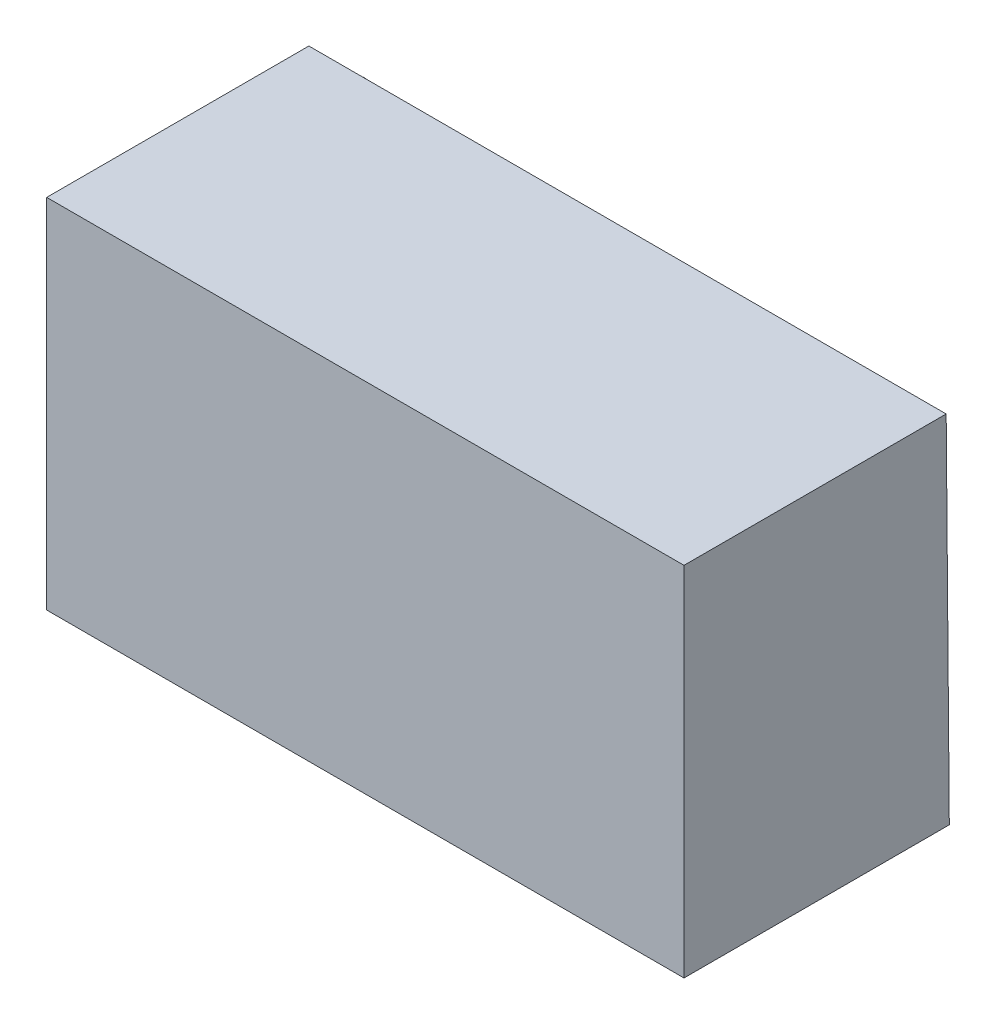
ISO-10303-21;
HEADER;
FILE_DESCRIPTION(('STEP AP214'),'2;1');
FILE_NAME('part.step','',(''),(''),'','','');
FILE_SCHEMA(('AUTOMOTIVE_DESIGN { 1 0 10303 214 1 1 1 1 }'));
ENDSEC;
DATA;
#1=APPLICATION_CONTEXT('core data for automotive mechanical design processes');
#2=APPLICATION_PROTOCOL_DEFINITION('international standard','automotive_design',2000,#1);
#3=PRODUCT_CONTEXT('',#1,'mechanical');
#4=PRODUCT('Part','Part','',(#3));
#5=PRODUCT_RELATED_PRODUCT_CATEGORY('part','',(#4));
#6=PRODUCT_DEFINITION_FORMATION('','',#4);
#7=PRODUCT_DEFINITION_CONTEXT('part definition',#1,'design');
#8=PRODUCT_DEFINITION('design','',#6,#7);
#9=PRODUCT_DEFINITION_SHAPE('','',#8);
#10=(LENGTH_UNIT() NAMED_UNIT(*) SI_UNIT(.MILLI.,.METRE.));
#11=(NAMED_UNIT(*) PLANE_ANGLE_UNIT() SI_UNIT($,.RADIAN.));
#12=(NAMED_UNIT(*) SI_UNIT($,.STERADIAN.) SOLID_ANGLE_UNIT());
#13=UNCERTAINTY_MEASURE_WITH_UNIT(LENGTH_MEASURE(1.E-05),#10,'distance_accuracy_value','');
#14=(GEOMETRIC_REPRESENTATION_CONTEXT(3) GLOBAL_UNCERTAINTY_ASSIGNED_CONTEXT((#13)) GLOBAL_UNIT_ASSIGNED_CONTEXT((#10,
#11,#12)) REPRESENTATION_CONTEXT('',''));
#15=CARTESIAN_POINT('',(0.,0.,0.));
#16=DIRECTION('',(0.,0.,1.));
#17=DIRECTION('',(1.,0.,0.));
#18=AXIS2_PLACEMENT_3D('',#15,#16,#17);
#19=CARTESIAN_POINT('',(-4.00000000000008,22.9122396448505,110.199952086171));
#20=DIRECTION('',(0.,-1.,0.));
#21=DIRECTION('',(1.,0.,0.));
#22=AXIS2_PLACEMENT_3D('',#19,#20,#21);
#23=PLANE('',#22);
#24=DIRECTION('',(1.,0.,0.));
#25=VECTOR('',#24,1.);
#26=CARTESIAN_POINT('',(190.,22.9122396448505,160.));
#27=LINE('',#26,#25);
#28=CARTESIAN_POINT('',(-123.631953553335,22.9122396448505,160.));
#29=VERTEX_POINT('',#28);
#30=CARTESIAN_POINT('',(-4.00000000000009,22.9122396448505,160.));
#31=VERTEX_POINT('',#30);
#32=EDGE_CURVE('E171',#29,#31,#27,.T.);
#33=ORIENTED_EDGE('',*,*,#32,.F.);
#34=DIRECTION('',(0.,0.,1.));
#35=VECTOR('',#34,1.);
#36=CARTESIAN_POINT('',(-123.631953553335,22.9122396448505,110.199952086171));
#37=LINE('',#36,#35);
#38=CARTESIAN_POINT('',(-123.631953553335,22.9122396448505,110.199952086171));
#39=VERTEX_POINT('',#38);
#40=EDGE_CURVE('E11',#39,#29,#37,.T.);
#41=ORIENTED_EDGE('',*,*,#40,.F.);
#42=DIRECTION('',(1.,0.,0.));
#43=VECTOR('',#42,1.);
#44=CARTESIAN_POINT('',(-135.,22.9122396448505,110.199952086171));
#45=LINE('',#44,#43);
#46=CARTESIAN_POINT('',(-4.00000000000009,22.9122396448505,110.199952086171));
#47=VERTEX_POINT('',#46);
#48=EDGE_CURVE('E183',#47,#39,#45,.F.);
#49=ORIENTED_EDGE('',*,*,#48,.F.);
#50=DIRECTION('',(0.,0.,1.));
#51=VECTOR('',#50,1.);
#52=CARTESIAN_POINT('',(-4.00000000000008,22.9122396448505,110.199952086171));
#53=LINE('',#52,#51);
#54=EDGE_CURVE('E49',#47,#31,#53,.T.);
#55=ORIENTED_EDGE('',*,*,#54,.T.);
#56=EDGE_LOOP('',(#33,#41,#49,#55));
#57=FACE_BOUND('',#56,.T.);
#58=ADVANCED_FACE('F39',(#57),#23,.T.);
#59=CARTESIAN_POINT('',(-123.631953553335,22.9122396448505,110.199952086171));
#60=DIRECTION('',(-1.,0.,0.));
#61=DIRECTION('',(0.,0.,1.));
#62=AXIS2_PLACEMENT_3D('',#59,#60,#61);
#63=PLANE('',#62);
#64=DIRECTION('',(0.,-1.,0.));
#65=VECTOR('',#64,1.);
#66=CARTESIAN_POINT('',(-123.631953553335,125.,160.));
#67=LINE('',#66,#65);
#68=CARTESIAN_POINT('',(-123.631953553335,90.0001903846792,160.));
#69=VERTEX_POINT('',#68);
#70=EDGE_CURVE('E174',#69,#29,#67,.T.);
#71=ORIENTED_EDGE('',*,*,#70,.F.);
#72=DIRECTION('',(0.,0.,1.));
#73=VECTOR('',#72,1.);
#74=CARTESIAN_POINT('',(-123.631953553335,90.0001903846792,110.78541976263));
#75=LINE('',#74,#73);
#76=CARTESIAN_POINT('',(-123.631953553335,90.0001903846792,110.78541976263));
#77=VERTEX_POINT('',#76);
#78=EDGE_CURVE('E164',#77,#69,#75,.T.);
#79=ORIENTED_EDGE('',*,*,#78,.F.);
#80=DIRECTION('',(0.,-0.999961923064171,-0.00872653549837395));
#81=VECTOR('',#80,1.);
#82=CARTESIAN_POINT('',(-123.631953553335,0.,110.));
#83=LINE('',#82,#81);
#84=EDGE_CURVE('E186',#39,#77,#83,.F.);
#85=ORIENTED_EDGE('',*,*,#84,.F.);
#86=ORIENTED_EDGE('',*,*,#40,.T.);
#87=EDGE_LOOP('',(#71,#79,#85,#86));
#88=FACE_BOUND('',#87,.T.);
#89=ADVANCED_FACE('F405',(#88),#63,.T.);
#90=CARTESIAN_POINT('',(-4.00000000000008,22.9122396448505,110.199952086171));
#91=DIRECTION('',(1.,0.,0.));
#92=DIRECTION('',(0.,0.,-1.));
#93=AXIS2_PLACEMENT_3D('',#90,#91,#92);
#94=PLANE('',#93);
#95=DIRECTION('',(0.,1.,0.));
#96=VECTOR('',#95,1.);
#97=CARTESIAN_POINT('',(-4.00000000000009,125.,160.));
#98=LINE('',#97,#96);
#99=CARTESIAN_POINT('',(-4.00000000000009,90.0001903846792,160.));
#100=VERTEX_POINT('',#99);
#101=EDGE_CURVE('E180',#31,#100,#98,.T.);
#102=ORIENTED_EDGE('',*,*,#101,.F.);
#103=ORIENTED_EDGE('',*,*,#54,.F.);
#104=DIRECTION('',(0.,0.999961923064171,0.00872653549837395));
#105=VECTOR('',#104,1.);
#106=CARTESIAN_POINT('',(-4.00000000000009,0.,110.));
#107=LINE('',#106,#105);
#108=CARTESIAN_POINT('',(-4.00000000000009,90.0001903846792,110.78541976263));
#109=VERTEX_POINT('',#108);
#110=EDGE_CURVE('E43',#109,#47,#107,.F.);
#111=ORIENTED_EDGE('',*,*,#110,.F.);
#112=DIRECTION('',(0.,0.,1.));
#113=VECTOR('',#112,1.);
#114=CARTESIAN_POINT('',(-4.00000000000008,90.0001903846792,110.78541976263));
#115=LINE('',#114,#113);
#116=EDGE_CURVE('E167',#109,#100,#115,.T.);
#117=ORIENTED_EDGE('',*,*,#116,.T.);
#118=EDGE_LOOP('',(#102,#103,#111,#117));
#119=FACE_BOUND('',#118,.T.);
#120=ADVANCED_FACE('F204',(#119),#94,.T.);
#121=CARTESIAN_POINT('',(-4.00000000000008,90.0001903846792,110.78541976263));
#122=DIRECTION('',(0.,1.,0.));
#123=DIRECTION('',(-1.,0.,0.));
#124=AXIS2_PLACEMENT_3D('',#121,#122,#123);
#125=PLANE('',#124);
#126=DIRECTION('',(-1.,0.,0.));
#127=VECTOR('',#126,1.);
#128=CARTESIAN_POINT('',(190.,90.0001903846792,160.));
#129=LINE('',#128,#127);
#130=EDGE_CURVE('E177',#100,#69,#129,.T.);
#131=ORIENTED_EDGE('',*,*,#130,.F.);
#132=ORIENTED_EDGE('',*,*,#116,.F.);
#133=DIRECTION('',(-1.,0.,0.));
#134=VECTOR('',#133,1.);
#135=CARTESIAN_POINT('',(-135.,90.0001903846792,110.78541976263));
#136=LINE('',#135,#134);
#137=EDGE_CURVE('E188',#77,#109,#136,.F.);
#138=ORIENTED_EDGE('',*,*,#137,.F.);
#139=ORIENTED_EDGE('',*,*,#78,.T.);
#140=EDGE_LOOP('',(#131,#132,#138,#139));
#141=FACE_BOUND('',#140,.T.);
#142=ADVANCED_FACE('F396',(#141),#125,.T.);
#143=CARTESIAN_POINT('',(190.,125.,160.));
#144=DIRECTION('',(0.,0.,1.));
#145=DIRECTION('',(1.,0.,0.));
#146=AXIS2_PLACEMENT_3D('',#143,#144,#145);
#147=PLANE('',#146);
#148=ORIENTED_EDGE('',*,*,#32,.T.);
#149=ORIENTED_EDGE('',*,*,#101,.T.);
#150=ORIENTED_EDGE('',*,*,#130,.T.);
#151=ORIENTED_EDGE('',*,*,#70,.T.);
#152=EDGE_LOOP('',(#148,#149,#150,#151));
#153=FACE_BOUND('',#152,.T.);
#154=ADVANCED_FACE('F394',(#153),#147,.T.);
#155=CARTESIAN_POINT('',(-135.,0.,110.));
#156=DIRECTION('',(0.,-0.00872653549837395,0.999961923064171));
#157=DIRECTION('',(0.,-0.999961923064171,-0.00872653549837395));
#158=AXIS2_PLACEMENT_3D('',#155,#156,#157);
#159=PLANE('',#158);
#160=CARTESIAN_POINT('',(-115.741787099636,85.0003807693583,110.741787085138));
#161=DIRECTION('',(0.,-0.00872653549837395,0.999961923064171));
#162=DIRECTION('',(0.,-0.999961923064171,-0.00872653549837395));
#163=AXIS2_PLACEMENT_3D('',#160,#161,#162);
#164=CIRCLE('',#163,2.5);
#165=CARTESIAN_POINT('',(-115.741787099636,82.5004759616979,110.719970746392));
#166=VERTEX_POINT('',#165);
#167=EDGE_CURVE('E262',#166,#166,#164,.T.);
#168=ORIENTED_EDGE('',*,*,#167,.T.);
#169=EDGE_LOOP('',(#168));
#170=FACE_BOUND('',#169,.T.);
#171=DIRECTION('',(1.,0.,0.));
#172=VECTOR('',#171,1.);
#173=CARTESIAN_POINT('',(-39.0000000000001,32.9118588754922,110.287217441155));
#174=LINE('',#173,#172);
#175=CARTESIAN_POINT('',(-39.0000000000001,32.9118588754922,110.287217441155));
#176=VERTEX_POINT('',#175);
#177=CARTESIAN_POINT('',(-19.0000000000001,32.9118588754922,110.287217441155));
#178=VERTEX_POINT('',#177);
#179=EDGE_CURVE('E244',#176,#178,#174,.T.);
#180=ORIENTED_EDGE('',*,*,#179,.T.);
#181=DIRECTION('',(0.,0.999961923064171,0.00872653549837399));
#182=VECTOR('',#181,1.);
#183=CARTESIAN_POINT('',(-19.0000000000001,47.9112877214548,110.41811547363));
#184=LINE('',#183,#182);
#185=CARTESIAN_POINT('',(-19.0000000000001,47.9112877214548,110.41811547363));
#186=VERTEX_POINT('',#185);
#187=EDGE_CURVE('E256',#178,#186,#184,.T.);
#188=ORIENTED_EDGE('',*,*,#187,.T.);
#189=DIRECTION('',(-1.,0.,0.));
#190=VECTOR('',#189,1.);
#191=CARTESIAN_POINT('',(-39.0000000000001,47.9112877214548,110.41811547363));
#192=LINE('',#191,#190);
#193=CARTESIAN_POINT('',(-39.0000000000001,47.9112877214548,110.41811547363));
#194=VERTEX_POINT('',#193);
#195=EDGE_CURVE('E58',#186,#194,#192,.T.);
#196=ORIENTED_EDGE('',*,*,#195,.T.);
#197=DIRECTION('',(0.,-0.999961923064171,-0.008726535498374));
#198=VECTOR('',#197,1.);
#199=CARTESIAN_POINT('',(-39.0000000000001,47.9112877214548,110.41811547363));
#200=LINE('',#199,#198);
#201=EDGE_CURVE('E258',#194,#176,#200,.T.);
#202=ORIENTED_EDGE('',*,*,#201,.T.);
#203=EDGE_LOOP('',(#180,#188,#196,#202));
#204=FACE_BOUND('',#203,.T.);
#205=CARTESIAN_POINT('',(-31.0000000000001,66.910564259674,110.583919648099));
#206=DIRECTION('',(0.,-0.00872653549837395,0.999961923064171));
#207=DIRECTION('',(0.,-0.999961923064171,-0.00872653549837395));
#208=AXIS2_PLACEMENT_3D('',#205,#206,#207);
#209=CIRCLE('',#208,8.00000000000003);
#210=CARTESIAN_POINT('',(-31.0000000000001,58.9108688751606,110.514107364112));
#211=VERTEX_POINT('',#210);
#212=EDGE_CURVE('E255',#211,#211,#209,.T.);
#213=ORIENTED_EDGE('',*,*,#212,.T.);
#214=EDGE_LOOP('',(#213));
#215=FACE_BOUND('',#214,.T.);
#216=DIRECTION('',(1.,0.,0.));
#217=VECTOR('',#216,1.);
#218=CARTESIAN_POINT('',(-90.0000000000001,32.9118588754922,110.287217441155));
#219=LINE('',#218,#217);
#220=CARTESIAN_POINT('',(-90.0000000000001,32.9118588754922,110.287217441155));
#221=VERTEX_POINT('',#220);
#222=CARTESIAN_POINT('',(-59.0000000000001,32.9118588754922,110.287217441155));
#223=VERTEX_POINT('',#222);
#224=EDGE_CURVE('E336',#221,#223,#219,.T.);
#225=ORIENTED_EDGE('',*,*,#224,.T.);
#226=DIRECTION('',(0.,0.999961923064171,0.008726535498374));
#227=VECTOR('',#226,1.);
#228=CARTESIAN_POINT('',(-59.0000000000001,47.9112877214548,110.41811547363));
#229=LINE('',#228,#227);
#230=CARTESIAN_POINT('',(-59.0000000000001,47.9112877214548,110.41811547363));
#231=VERTEX_POINT('',#230);
#232=EDGE_CURVE('E302',#223,#231,#229,.T.);
#233=ORIENTED_EDGE('',*,*,#232,.T.);
#234=DIRECTION('',(-1.,0.,0.));
#235=VECTOR('',#234,1.);
#236=CARTESIAN_POINT('',(-90.0000000000001,47.9112877214548,110.41811547363));
#237=LINE('',#236,#235);
#238=CARTESIAN_POINT('',(-90.0000000000001,47.9112877214548,110.41811547363));
#239=VERTEX_POINT('',#238);
#240=EDGE_CURVE('E320',#231,#239,#237,.T.);
#241=ORIENTED_EDGE('',*,*,#240,.T.);
#242=DIRECTION('',(0.,-0.999961923064171,-0.008726535498374));
#243=VECTOR('',#242,1.);
#244=CARTESIAN_POINT('',(-90.0000000000001,47.9112877214548,110.41811547363));
#245=LINE('',#244,#243);
#246=EDGE_CURVE('E295',#239,#221,#245,.T.);
#247=ORIENTED_EDGE('',*,*,#246,.T.);
#248=EDGE_LOOP('',(#225,#233,#241,#247));
#249=FACE_BOUND('',#248,.T.);
#250=DIRECTION('',(1.,0.,0.));
#251=VECTOR('',#250,1.);
#252=CARTESIAN_POINT('',(-90.0000000000001,59.9108307982248,110.522833899611));
#253=LINE('',#252,#251);
#254=CARTESIAN_POINT('',(-90.0000000000001,59.9108307982248,110.522833899611));
#255=VERTEX_POINT('',#254);
#256=CARTESIAN_POINT('',(-59.0000000000001,59.9108307982248,110.522833899611));
#257=VERTEX_POINT('',#256);
#258=EDGE_CURVE('E123',#255,#257,#253,.T.);
#259=ORIENTED_EDGE('',*,*,#258,.T.);
#260=DIRECTION('',(0.,0.999961923064171,0.00872653549837399));
#261=VECTOR('',#260,1.);
#262=CARTESIAN_POINT('',(-59.,74.9102596441874,110.653731932086));
#263=LINE('',#262,#261);
#264=CARTESIAN_POINT('',(-59.,74.9102596441874,110.653731932086));
#265=VERTEX_POINT('',#264);
#266=EDGE_CURVE('E160',#257,#265,#263,.T.);
#267=ORIENTED_EDGE('',*,*,#266,.T.);
#268=DIRECTION('',(-1.,0.,0.));
#269=VECTOR('',#268,1.);
#270=CARTESIAN_POINT('',(-90.0000000000001,74.9102596441874,110.653731932086));
#271=LINE('',#270,#269);
#272=CARTESIAN_POINT('',(-90.0000000000001,74.9102596441874,110.653731932086));
#273=VERTEX_POINT('',#272);
#274=EDGE_CURVE('E144',#265,#273,#271,.T.);
#275=ORIENTED_EDGE('',*,*,#274,.T.);
#276=DIRECTION('',(0.,-0.999961923064171,-0.00872653549837399));
#277=VECTOR('',#276,1.);
#278=CARTESIAN_POINT('',(-90.0000000000001,74.9102596441874,110.653731932086));
#279=LINE('',#278,#277);
#280=EDGE_CURVE('E159',#273,#255,#279,.T.);
#281=ORIENTED_EDGE('',*,*,#280,.T.);
#282=EDGE_LOOP('',(#259,#267,#275,#281));
#283=FACE_BOUND('',#282,.T.);
#284=ORIENTED_EDGE('',*,*,#137,.T.);
#285=ORIENTED_EDGE('',*,*,#110,.T.);
#286=ORIENTED_EDGE('',*,*,#48,.T.);
#287=ORIENTED_EDGE('',*,*,#84,.T.);
#288=EDGE_LOOP('',(#284,#285,#286,#287));
#289=FACE_BOUND('',#288,.T.);
#290=ADVANCED_FACE('F41',(#170,#204,#215,#249,#283,#289),#159,.F.);
#291=CARTESIAN_POINT('',(0.,-0.938066015055126,107.491718426144));
#292=DIRECTION('',(0.,0.0087265354960363,-0.999961923064192));
#293=DIRECTION('',(0.,0.999961923064192,0.0087265354960363));
#294=AXIS2_PLACEMENT_3D('',#291,#292,#293);
#295=PLANE('',#294);
#296=CARTESIAN_POINT('',(-115.741787099636,85.0221971081043,108.241882277478));
#297=DIRECTION('',(0.,-0.00872653549837395,0.999961923064171));
#298=DIRECTION('',(0.,-0.999961923064171,-0.00872653549837395));
#299=AXIS2_PLACEMENT_3D('',#296,#297,#298);
#300=CIRCLE('',#299,2.5);
#301=CARTESIAN_POINT('',(-115.741787099636,82.5222923004438,108.220065938732));
#302=VERTEX_POINT('',#301);
#303=EDGE_CURVE('E156',#302,#302,#300,.F.);
#304=ORIENTED_EDGE('',*,*,#303,.T.);
#305=EDGE_LOOP('',(#304));
#306=FACE_BOUND('',#305,.T.);
#307=ADVANCED_FACE('F402',(#306),#295,.T.);
#308=CARTESIAN_POINT('',(2.92580071804906E-13,-0.938066015304696,107.491718425941));
#309=DIRECTION('',(0.,0.00872653549837427,-0.999961923064171));
#310=DIRECTION('',(0.,0.999961923064171,0.00872653549837427));
#311=AXIS2_PLACEMENT_3D('',#308,#309,#310);
#312=PLANE('',#311);
#313=DIRECTION('',(1.,0.,0.));
#314=VECTOR('',#313,1.);
#315=CARTESIAN_POINT('',(-135.,32.9336752142381,107.787312633494));
#316=LINE('',#315,#314);
#317=CARTESIAN_POINT('',(-19.0000000000001,32.9336752142381,107.787312633494));
#318=VERTEX_POINT('',#317);
#319=CARTESIAN_POINT('',(-39.0000000000001,32.9336752142381,107.787312633494));
#320=VERTEX_POINT('',#319);
#321=EDGE_CURVE('E284',#318,#320,#316,.F.);
#322=ORIENTED_EDGE('',*,*,#321,.T.);
#323=DIRECTION('',(0.,-0.999961923064171,-0.00872653549837395));
#324=VECTOR('',#323,1.);
#325=CARTESIAN_POINT('',(-39.0000000000001,0.0218163387459793,107.50009519234));
#326=LINE('',#325,#324);
#327=CARTESIAN_POINT('',(-39.0000000000001,47.9331040602007,107.91821066597));
#328=VERTEX_POINT('',#327);
#329=EDGE_CURVE('E265',#320,#328,#326,.F.);
#330=ORIENTED_EDGE('',*,*,#329,.T.);
#331=DIRECTION('',(-1.,0.,0.));
#332=VECTOR('',#331,1.);
#333=CARTESIAN_POINT('',(-135.,47.9331040602006,107.91821066597));
#334=LINE('',#333,#332);
#335=CARTESIAN_POINT('',(-19.0000000000001,47.9331040602007,107.91821066597));
#336=VERTEX_POINT('',#335);
#337=EDGE_CURVE('E464',#328,#336,#334,.F.);
#338=ORIENTED_EDGE('',*,*,#337,.T.);
#339=DIRECTION('',(0.,0.999961923064171,0.00872653549837395));
#340=VECTOR('',#339,1.);
#341=CARTESIAN_POINT('',(-19.0000000000001,0.0218163387459349,107.50009519234));
#342=LINE('',#341,#340);
#343=EDGE_CURVE('E291',#336,#318,#342,.F.);
#344=ORIENTED_EDGE('',*,*,#343,.T.);
#345=EDGE_LOOP('',(#322,#330,#338,#344));
#346=FACE_BOUND('',#345,.T.);
#347=ADVANCED_FACE('F391',(#346),#312,.T.);
#348=CARTESIAN_POINT('',(0.,-0.938066015304708,107.491718425941));
#349=DIRECTION('',(0.,0.0087265354983744,-0.999961923064171));
#350=DIRECTION('',(0.,0.999961923064171,0.0087265354983744));
#351=AXIS2_PLACEMENT_3D('',#348,#349,#350);
#352=PLANE('',#351);
#353=CARTESIAN_POINT('',(-31.0000000000001,66.93238059842,108.084014840439));
#354=DIRECTION('',(0.,-0.00872653549837395,0.999961923064171));
#355=DIRECTION('',(0.,-0.999961923064171,-0.00872653549837395));
#356=AXIS2_PLACEMENT_3D('',#353,#354,#355);
#357=CIRCLE('',#356,8.00000000000003);
#358=CARTESIAN_POINT('',(-31.0000000000001,58.9326852139066,108.014202556452));
#359=VERTEX_POINT('',#358);
#360=EDGE_CURVE('E287',#359,#359,#357,.F.);
#361=ORIENTED_EDGE('',*,*,#360,.T.);
#362=EDGE_LOOP('',(#361));
#363=FACE_BOUND('',#362,.T.);
#364=ADVANCED_FACE('F383',(#363),#352,.T.);
#365=CARTESIAN_POINT('',(0.,-0.938066015304607,107.491718425941));
#366=DIRECTION('',(0.,0.00872653549837343,-0.999961923064171));
#367=DIRECTION('',(0.,0.999961923064171,0.00872653549837343));
#368=AXIS2_PLACEMENT_3D('',#365,#366,#367);
#369=PLANE('',#368);
#370=DIRECTION('',(1.,0.,0.));
#371=VECTOR('',#370,1.);
#372=CARTESIAN_POINT('',(-135.,32.9336752142381,107.787312633494));
#373=LINE('',#372,#371);
#374=CARTESIAN_POINT('',(-59.0000000000001,32.9336752142381,107.787312633494));
#375=VERTEX_POINT('',#374);
#376=CARTESIAN_POINT('',(-90.,32.9336752142381,107.787312633494));
#377=VERTEX_POINT('',#376);
#378=EDGE_CURVE('E292',#375,#377,#373,.F.);
#379=ORIENTED_EDGE('',*,*,#378,.T.);
#380=DIRECTION('',(0.,-0.999961923064171,-0.00872653549837395));
#381=VECTOR('',#380,1.);
#382=CARTESIAN_POINT('',(-90.0000000000001,0.0218163387459349,107.50009519234));
#383=LINE('',#382,#381);
#384=CARTESIAN_POINT('',(-90.,47.9331040602007,107.91821066597));
#385=VERTEX_POINT('',#384);
#386=EDGE_CURVE('E317',#377,#385,#383,.F.);
#387=ORIENTED_EDGE('',*,*,#386,.T.);
#388=DIRECTION('',(-1.,0.,0.));
#389=VECTOR('',#388,1.);
#390=CARTESIAN_POINT('',(-135.,47.9331040602007,107.91821066597));
#391=LINE('',#390,#389);
#392=CARTESIAN_POINT('',(-59.0000000000001,47.9331040602007,107.91821066597));
#393=VERTEX_POINT('',#392);
#394=EDGE_CURVE('E298',#385,#393,#391,.F.);
#395=ORIENTED_EDGE('',*,*,#394,.T.);
#396=DIRECTION('',(0.,0.999961923064171,0.00872653549837395));
#397=VECTOR('',#396,1.);
#398=CARTESIAN_POINT('',(-59.,0.0218163387460052,107.50009519234));
#399=LINE('',#398,#397);
#400=EDGE_CURVE('E115',#393,#375,#399,.F.);
#401=ORIENTED_EDGE('',*,*,#400,.T.);
#402=EDGE_LOOP('',(#379,#387,#395,#401));
#403=FACE_BOUND('',#402,.T.);
#404=ADVANCED_FACE('F381',(#403),#369,.T.);
#405=CARTESIAN_POINT('',(0.,-0.938066015304107,107.491718425942));
#406=DIRECTION('',(0.,0.00872653549836875,-0.999961923064171));
#407=DIRECTION('',(0.,0.999961923064171,0.00872653549836875));
#408=AXIS2_PLACEMENT_3D('',#405,#406,#407);
#409=PLANE('',#408);
#410=DIRECTION('',(1.,0.,0.));
#411=VECTOR('',#410,1.);
#412=CARTESIAN_POINT('',(-135.,59.9326471369708,108.02292909195));
#413=LINE('',#412,#411);
#414=CARTESIAN_POINT('',(-59.0000000000001,59.9326471369708,108.02292909195));
#415=VERTEX_POINT('',#414);
#416=CARTESIAN_POINT('',(-90.0000000000001,59.9326471369708,108.02292909195));
#417=VERTEX_POINT('',#416);
#418=EDGE_CURVE('E103',#415,#417,#413,.F.);
#419=ORIENTED_EDGE('',*,*,#418,.T.);
#420=DIRECTION('',(0.,-0.999961923064171,-0.00872653549837395));
#421=VECTOR('',#420,1.);
#422=CARTESIAN_POINT('',(-90.0000000000001,0.0218163387458933,107.50009519234));
#423=LINE('',#422,#421);
#424=CARTESIAN_POINT('',(-90.,74.9320759829333,108.153827124426));
#425=VERTEX_POINT('',#424);
#426=EDGE_CURVE('E107',#417,#425,#423,.F.);
#427=ORIENTED_EDGE('',*,*,#426,.T.);
#428=DIRECTION('',(-1.,0.,0.));
#429=VECTOR('',#428,1.);
#430=CARTESIAN_POINT('',(-135.,74.9320759829333,108.153827124426));
#431=LINE('',#430,#429);
#432=CARTESIAN_POINT('',(-59.,74.9320759829333,108.153827124426));
#433=VERTEX_POINT('',#432);
#434=EDGE_CURVE('E134',#425,#433,#431,.F.);
#435=ORIENTED_EDGE('',*,*,#434,.T.);
#436=DIRECTION('',(0.,0.999961923064171,0.00872653549837395));
#437=VECTOR('',#436,1.);
#438=CARTESIAN_POINT('',(-59.0000000000002,0.0218163387457943,107.50009519234));
#439=LINE('',#438,#437);
#440=EDGE_CURVE('E110',#433,#415,#439,.F.);
#441=ORIENTED_EDGE('',*,*,#440,.T.);
#442=EDGE_LOOP('',(#419,#427,#435,#441));
#443=FACE_BOUND('',#442,.T.);
#444=ADVANCED_FACE('F105',(#443),#409,.T.);
#445=CARTESIAN_POINT('',(-115.741787099636,85.2185441568177,85.7427390085341));
#446=DIRECTION('',(0.,-0.00872653549837395,0.999961923064171));
#447=DIRECTION('',(0.,-0.999961923064171,-0.00872653549837395));
#448=AXIS2_PLACEMENT_3D('',#445,#446,#447);
#449=CYLINDRICAL_SURFACE('',#448,2.5);
#450=ORIENTED_EDGE('',*,*,#303,.F.);
#451=EDGE_LOOP('',(#450));
#452=FACE_BOUND('',#451,.T.);
#453=ORIENTED_EDGE('',*,*,#167,.F.);
#454=EDGE_LOOP('',(#453));
#455=FACE_BOUND('',#454,.T.);
#456=ADVANCED_FACE('F389',(#452,#455),#449,.T.);
#457=CARTESIAN_POINT('',(-39.0000000000001,48.1294511089141,85.4190673970259));
#458=DIRECTION('',(-1.,0.,0.));
#459=DIRECTION('',(0.,-1.,0.));
#460=AXIS2_PLACEMENT_3D('',#457,#458,#459);
#461=PLANE('',#460);
#462=ORIENTED_EDGE('',*,*,#329,.F.);
#463=DIRECTION('',(0.,-0.00872653549837395,0.999961923064171));
#464=VECTOR('',#463,1.);
#465=CARTESIAN_POINT('',(-39.0000000000001,33.1300222629516,85.2881693645502));
#466=LINE('',#465,#464);
#467=EDGE_CURVE('E249',#320,#176,#466,.T.);
#468=ORIENTED_EDGE('',*,*,#467,.T.);
#469=ORIENTED_EDGE('',*,*,#201,.F.);
#470=DIRECTION('',(0.,-0.00872653549837395,0.999961923064171));
#471=VECTOR('',#470,1.);
#472=CARTESIAN_POINT('',(-39.0000000000001,48.1294511089141,85.4190673970259));
#473=LINE('',#472,#471);
#474=EDGE_CURVE('E266',#328,#194,#473,.T.);
#475=ORIENTED_EDGE('',*,*,#474,.F.);
#476=EDGE_LOOP('',(#462,#468,#469,#475));
#477=FACE_BOUND('',#476,.T.);
#478=ADVANCED_FACE('F264',(#477),#461,.T.);
#479=CARTESIAN_POINT('',(-39.0000000000001,48.1294511089141,85.4190673970259));
#480=DIRECTION('',(0.,0.999961923064171,0.00872653549837395));
#481=DIRECTION('',(0.,-0.00872653549837395,0.999961923064171));
#482=AXIS2_PLACEMENT_3D('',#479,#480,#481);
#483=PLANE('',#482);
#484=ORIENTED_EDGE('',*,*,#337,.F.);
#485=ORIENTED_EDGE('',*,*,#474,.T.);
#486=ORIENTED_EDGE('',*,*,#195,.F.);
#487=DIRECTION('',(0.,-0.00872653549837395,0.999961923064171));
#488=VECTOR('',#487,1.);
#489=CARTESIAN_POINT('',(-19.0000000000001,48.1294511089141,85.4190673970259));
#490=LINE('',#489,#488);
#491=EDGE_CURVE('E170',#336,#186,#490,.T.);
#492=ORIENTED_EDGE('',*,*,#491,.F.);
#493=EDGE_LOOP('',(#484,#485,#486,#492));
#494=FACE_BOUND('',#493,.T.);
#495=ADVANCED_FACE('F421',(#494),#483,.T.);
#496=CARTESIAN_POINT('',(-19.0000000000001,48.1294511089141,85.4190673970259));
#497=DIRECTION('',(1.,0.,0.));
#498=DIRECTION('',(0.,0.,-1.));
#499=AXIS2_PLACEMENT_3D('',#496,#497,#498);
#500=PLANE('',#499);
#501=ORIENTED_EDGE('',*,*,#343,.F.);
#502=ORIENTED_EDGE('',*,*,#491,.T.);
#503=ORIENTED_EDGE('',*,*,#187,.F.);
#504=DIRECTION('',(0.,-0.00872653549837395,0.999961923064171));
#505=VECTOR('',#504,1.);
#506=CARTESIAN_POINT('',(-19.0000000000001,33.1300222629516,85.2881693645502));
#507=LINE('',#506,#505);
#508=EDGE_CURVE('E252',#318,#178,#507,.T.);
#509=ORIENTED_EDGE('',*,*,#508,.F.);
#510=EDGE_LOOP('',(#501,#502,#503,#509));
#511=FACE_BOUND('',#510,.T.);
#512=ADVANCED_FACE('F418',(#511),#500,.T.);
#513=CARTESIAN_POINT('',(-39.0000000000001,33.1300222629516,85.2881693645502));
#514=DIRECTION('',(0.,-0.999961923064171,-0.00872653549837395));
#515=DIRECTION('',(0.,0.00872653549837395,-0.999961923064171));
#516=AXIS2_PLACEMENT_3D('',#513,#514,#515);
#517=PLANE('',#516);
#518=ORIENTED_EDGE('',*,*,#321,.F.);
#519=ORIENTED_EDGE('',*,*,#508,.T.);
#520=ORIENTED_EDGE('',*,*,#179,.F.);
#521=ORIENTED_EDGE('',*,*,#467,.F.);
#522=EDGE_LOOP('',(#518,#519,#520,#521));
#523=FACE_BOUND('',#522,.T.);
#524=ADVANCED_FACE('F247',(#523),#517,.T.);
#525=CARTESIAN_POINT('',(-31.0000000000001,67.1287276471334,85.584871571495));
#526=DIRECTION('',(0.,-0.00872653549837395,0.999961923064171));
#527=DIRECTION('',(0.,-0.999961923064171,-0.00872653549837395));
#528=AXIS2_PLACEMENT_3D('',#525,#526,#527);
#529=CYLINDRICAL_SURFACE('',#528,8.00000000000003);
#530=ORIENTED_EDGE('',*,*,#360,.F.);
#531=EDGE_LOOP('',(#530));
#532=FACE_BOUND('',#531,.T.);
#533=ORIENTED_EDGE('',*,*,#212,.F.);
#534=EDGE_LOOP('',(#533));
#535=FACE_BOUND('',#534,.T.);
#536=ADVANCED_FACE('F429',(#532,#535),#529,.T.);
#537=CARTESIAN_POINT('',(-90.0000000000001,48.1294511089141,85.4190673970259));
#538=DIRECTION('',(-1.,0.,0.));
#539=DIRECTION('',(0.,0.,1.));
#540=AXIS2_PLACEMENT_3D('',#537,#538,#539);
#541=PLANE('',#540);
#542=ORIENTED_EDGE('',*,*,#386,.F.);
#543=DIRECTION('',(0.,-0.00872653549837395,0.999961923064171));
#544=VECTOR('',#543,1.);
#545=CARTESIAN_POINT('',(-90.0000000000001,33.1300222629516,85.2881693645502));
#546=LINE('',#545,#544);
#547=EDGE_CURVE('E313',#377,#221,#546,.T.);
#548=ORIENTED_EDGE('',*,*,#547,.T.);
#549=ORIENTED_EDGE('',*,*,#246,.F.);
#550=DIRECTION('',(0.,-0.00872653549837395,0.999961923064171));
#551=VECTOR('',#550,1.);
#552=CARTESIAN_POINT('',(-90.0000000000001,48.1294511089141,85.4190673970259));
#553=LINE('',#552,#551);
#554=EDGE_CURVE('E301',#385,#239,#553,.T.);
#555=ORIENTED_EDGE('',*,*,#554,.F.);
#556=EDGE_LOOP('',(#542,#548,#549,#555));
#557=FACE_BOUND('',#556,.T.);
#558=ADVANCED_FACE('F371',(#557),#541,.T.);
#559=CARTESIAN_POINT('',(-90.0000000000001,48.1294511089141,85.4190673970259));
#560=DIRECTION('',(0.,0.999961923064171,0.00872653549837395));
#561=DIRECTION('',(0.,-0.00872653549837395,0.999961923064171));
#562=AXIS2_PLACEMENT_3D('',#559,#560,#561);
#563=PLANE('',#562);
#564=ORIENTED_EDGE('',*,*,#394,.F.);
#565=ORIENTED_EDGE('',*,*,#554,.T.);
#566=ORIENTED_EDGE('',*,*,#240,.F.);
#567=DIRECTION('',(0.,-0.00872653549837395,0.999961923064171));
#568=VECTOR('',#567,1.);
#569=CARTESIAN_POINT('',(-59.0000000000001,48.1294511089141,85.4190673970259));
#570=LINE('',#569,#568);
#571=EDGE_CURVE('E269',#393,#231,#570,.T.);
#572=ORIENTED_EDGE('',*,*,#571,.F.);
#573=EDGE_LOOP('',(#564,#565,#566,#572));
#574=FACE_BOUND('',#573,.T.);
#575=ADVANCED_FACE('F368',(#574),#563,.T.);
#576=CARTESIAN_POINT('',(-59.0000000000001,48.1294511089141,85.4190673970259));
#577=DIRECTION('',(1.,0.,0.));
#578=DIRECTION('',(0.,1.,0.));
#579=AXIS2_PLACEMENT_3D('',#576,#577,#578);
#580=PLANE('',#579);
#581=ORIENTED_EDGE('',*,*,#400,.F.);
#582=ORIENTED_EDGE('',*,*,#571,.T.);
#583=ORIENTED_EDGE('',*,*,#232,.F.);
#584=DIRECTION('',(0.,-0.00872653549837395,0.999961923064171));
#585=VECTOR('',#584,1.);
#586=CARTESIAN_POINT('',(-59.0000000000001,33.1300222629516,85.2881693645502));
#587=LINE('',#586,#585);
#588=EDGE_CURVE('E310',#375,#223,#587,.T.);
#589=ORIENTED_EDGE('',*,*,#588,.F.);
#590=EDGE_LOOP('',(#581,#582,#583,#589));
#591=FACE_BOUND('',#590,.T.);
#592=ADVANCED_FACE('F379',(#591),#580,.T.);
#593=CARTESIAN_POINT('',(-90.0000000000001,33.1300222629516,85.2881693645502));
#594=DIRECTION('',(0.,-0.999961923064171,-0.00872653549837395));
#595=DIRECTION('',(0.,0.00872653549837395,-0.999961923064171));
#596=AXIS2_PLACEMENT_3D('',#593,#594,#595);
#597=PLANE('',#596);
#598=ORIENTED_EDGE('',*,*,#378,.F.);
#599=ORIENTED_EDGE('',*,*,#588,.T.);
#600=ORIENTED_EDGE('',*,*,#224,.F.);
#601=ORIENTED_EDGE('',*,*,#547,.F.);
#602=EDGE_LOOP('',(#598,#599,#600,#601));
#603=FACE_BOUND('',#602,.T.);
#604=ADVANCED_FACE('F375',(#603),#597,.T.);
#605=CARTESIAN_POINT('',(-90.0000000000001,75.1284230316468,85.654683855482));
#606=DIRECTION('',(-1.,0.,0.));
#607=DIRECTION('',(0.,-1.,0.));
#608=AXIS2_PLACEMENT_3D('',#605,#606,#607);
#609=PLANE('',#608);
#610=ORIENTED_EDGE('',*,*,#426,.F.);
#611=DIRECTION('',(0.,-0.00872653549837395,0.999961923064171));
#612=VECTOR('',#611,1.);
#613=CARTESIAN_POINT('',(-90.0000000000001,60.1289941856842,85.5237858230063));
#614=LINE('',#613,#612);
#615=EDGE_CURVE('E119',#417,#255,#614,.T.);
#616=ORIENTED_EDGE('',*,*,#615,.T.);
#617=ORIENTED_EDGE('',*,*,#280,.F.);
#618=DIRECTION('',(0.,-0.00872653549837395,0.999961923064171));
#619=VECTOR('',#618,1.);
#620=CARTESIAN_POINT('',(-90.0000000000001,75.1284230316468,85.654683855482));
#621=LINE('',#620,#619);
#622=EDGE_CURVE('E127',#425,#273,#621,.T.);
#623=ORIENTED_EDGE('',*,*,#622,.F.);
#624=EDGE_LOOP('',(#610,#616,#617,#623));
#625=FACE_BOUND('',#624,.T.);
#626=ADVANCED_FACE('F130',(#625),#609,.T.);
#627=CARTESIAN_POINT('',(-90.0000000000001,75.1284230316468,85.654683855482));
#628=DIRECTION('',(0.,0.999961923064171,0.00872653549837395));
#629=DIRECTION('',(0.,-0.00872653549837395,0.999961923064171));
#630=AXIS2_PLACEMENT_3D('',#627,#628,#629);
#631=PLANE('',#630);
#632=ORIENTED_EDGE('',*,*,#434,.F.);
#633=ORIENTED_EDGE('',*,*,#622,.T.);
#634=ORIENTED_EDGE('',*,*,#274,.F.);
#635=DIRECTION('',(0.,-0.00872653549837395,0.999961923064171));
#636=VECTOR('',#635,1.);
#637=CARTESIAN_POINT('',(-59.,75.1284230316468,85.654683855482));
#638=LINE('',#637,#636);
#639=EDGE_CURVE('E314',#433,#265,#638,.T.);
#640=ORIENTED_EDGE('',*,*,#639,.F.);
#641=EDGE_LOOP('',(#632,#633,#634,#640));
#642=FACE_BOUND('',#641,.T.);
#643=ADVANCED_FACE('F353',(#642),#631,.T.);
#644=CARTESIAN_POINT('',(-59.,75.1284230316468,85.654683855482));
#645=DIRECTION('',(1.,0.,0.));
#646=DIRECTION('',(0.,1.,0.));
#647=AXIS2_PLACEMENT_3D('',#644,#645,#646);
#648=PLANE('',#647);
#649=ORIENTED_EDGE('',*,*,#440,.F.);
#650=ORIENTED_EDGE('',*,*,#639,.T.);
#651=ORIENTED_EDGE('',*,*,#266,.F.);
#652=DIRECTION('',(0.,-0.00872653549837395,0.999961923064171));
#653=VECTOR('',#652,1.);
#654=CARTESIAN_POINT('',(-59.0000000000001,60.1289941856842,85.5237858230063));
#655=LINE('',#654,#653);
#656=EDGE_CURVE('E128',#415,#257,#655,.T.);
#657=ORIENTED_EDGE('',*,*,#656,.F.);
#658=EDGE_LOOP('',(#649,#650,#651,#657));
#659=FACE_BOUND('',#658,.T.);
#660=ADVANCED_FACE('F358',(#659),#648,.T.);
#661=CARTESIAN_POINT('',(-90.0000000000001,60.1289941856842,85.5237858230063));
#662=DIRECTION('',(0.,-0.999961923064171,-0.00872653549837395));
#663=DIRECTION('',(0.,0.00872653549837395,-0.999961923064171));
#664=AXIS2_PLACEMENT_3D('',#661,#662,#663);
#665=PLANE('',#664);
#666=ORIENTED_EDGE('',*,*,#418,.F.);
#667=ORIENTED_EDGE('',*,*,#656,.T.);
#668=ORIENTED_EDGE('',*,*,#258,.F.);
#669=ORIENTED_EDGE('',*,*,#615,.F.);
#670=EDGE_LOOP('',(#666,#667,#668,#669));
#671=FACE_BOUND('',#670,.T.);
#672=ADVANCED_FACE('F120',(#671),#665,.T.);
#673=CLOSED_SHELL('',(#58,#89,#120,#142,#154,#290,#307,#347,#364,#404,#444,#456,#478,#495,#512,
#524,#536,#558,#575,#592,#604,#626,#643,#660,#672));
#674=MANIFOLD_SOLID_BREP('B2',#673);
#675=ADVANCED_BREP_SHAPE_REPRESENTATION('',(#18,#674),#14);
#676=SHAPE_DEFINITION_REPRESENTATION(#9,#675);
ENDSEC;
END-ISO-10303-21;
